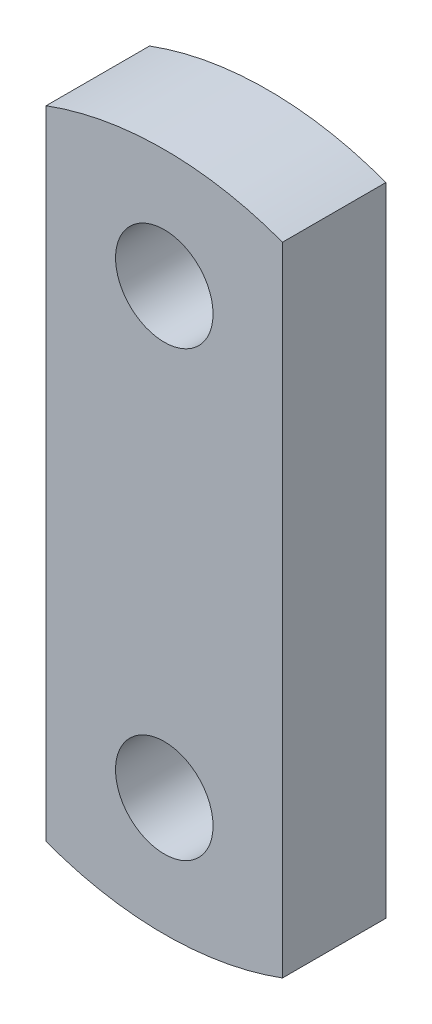
ISO-10303-21;
HEADER;
FILE_DESCRIPTION(('STEP AP214'),'2;1');
FILE_NAME('part.step','',(''),(''),'','','');
FILE_SCHEMA(('AUTOMOTIVE_DESIGN { 1 0 10303 214 1 1 1 1 }'));
ENDSEC;
DATA;
#1=APPLICATION_CONTEXT('core data for automotive mechanical design processes');
#2=APPLICATION_PROTOCOL_DEFINITION('international standard','automotive_design',2000,#1);
#3=PRODUCT_CONTEXT('',#1,'mechanical');
#4=PRODUCT('Part','Part','',(#3));
#5=PRODUCT_RELATED_PRODUCT_CATEGORY('part','',(#4));
#6=PRODUCT_DEFINITION_FORMATION('','',#4);
#7=PRODUCT_DEFINITION_CONTEXT('part definition',#1,'design');
#8=PRODUCT_DEFINITION('design','',#6,#7);
#9=PRODUCT_DEFINITION_SHAPE('','',#8);
#10=(LENGTH_UNIT() NAMED_UNIT(*) SI_UNIT(.MILLI.,.METRE.));
#11=(NAMED_UNIT(*) PLANE_ANGLE_UNIT() SI_UNIT($,.RADIAN.));
#12=(NAMED_UNIT(*) SI_UNIT($,.STERADIAN.) SOLID_ANGLE_UNIT());
#13=UNCERTAINTY_MEASURE_WITH_UNIT(LENGTH_MEASURE(1.E-05),#10,'distance_accuracy_value','');
#14=(GEOMETRIC_REPRESENTATION_CONTEXT(3) GLOBAL_UNCERTAINTY_ASSIGNED_CONTEXT((#13)) GLOBAL_UNIT_ASSIGNED_CONTEXT((#10,
#11,#12)) REPRESENTATION_CONTEXT('',''));
#15=CARTESIAN_POINT('',(0.,0.,0.));
#16=DIRECTION('',(0.,0.,1.));
#17=DIRECTION('',(1.,0.,0.));
#18=AXIS2_PLACEMENT_3D('',#15,#16,#17);
#19=CARTESIAN_POINT('',(-97.3725886780938,23.6588586332778,35.));
#20=DIRECTION('',(0.,0.,1.));
#21=DIRECTION('',(1.,0.,0.));
#22=AXIS2_PLACEMENT_3D('',#19,#20,#21);
#23=PLANE('',#22);
#24=CARTESIAN_POINT('',(-97.3725886780938,98.6588586332778,35.));
#25=DIRECTION('',(0.,0.,1.));
#26=DIRECTION('',(1.,0.,0.));
#27=AXIS2_PLACEMENT_3D('',#24,#25,#26);
#28=CIRCLE('',#27,16.5);
#29=CARTESIAN_POINT('',(-80.8725886780938,98.6588586332778,35.));
#30=VERTEX_POINT('',#29);
#31=EDGE_CURVE('E103',#30,#30,#28,.T.);
#32=ORIENTED_EDGE('',*,*,#31,.F.);
#33=EDGE_LOOP('',(#32));
#34=FACE_BOUND('',#33,.T.);
#35=CARTESIAN_POINT('',(-97.3725886780938,23.6588586332778,35.));
#36=DIRECTION('',(0.,0.,1.));
#37=DIRECTION('',(1.,0.,0.));
#38=AXIS2_PLACEMENT_3D('',#35,#36,#37);
#39=CIRCLE('',#38,115.);
#40=CARTESIAN_POINT('',(-137.372588678094,-84.1604346309613,35.));
#41=VERTEX_POINT('',#40);
#42=CARTESIAN_POINT('',(-57.3725886780938,-84.1604346309613,35.));
#43=VERTEX_POINT('',#42);
#44=EDGE_CURVE('E88',#41,#43,#39,.T.);
#45=ORIENTED_EDGE('',*,*,#44,.T.);
#46=DIRECTION('',(0.,1.,0.));
#47=VECTOR('',#46,1.);
#48=CARTESIAN_POINT('',(-57.3725886780938,131.478151897517,35.));
#49=LINE('',#48,#47);
#50=CARTESIAN_POINT('',(-57.3725886780938,131.478151897517,35.));
#51=VERTEX_POINT('',#50);
#52=EDGE_CURVE('E83',#43,#51,#49,.T.);
#53=ORIENTED_EDGE('',*,*,#52,.T.);
#54=CARTESIAN_POINT('',(-97.3725886780938,23.6588586332778,35.));
#55=DIRECTION('',(0.,0.,1.));
#56=DIRECTION('',(1.,0.,0.));
#57=AXIS2_PLACEMENT_3D('',#54,#55,#56);
#58=CIRCLE('',#57,115.);
#59=CARTESIAN_POINT('',(-137.372588678094,131.478151897517,35.));
#60=VERTEX_POINT('',#59);
#61=EDGE_CURVE('E86',#51,#60,#58,.T.);
#62=ORIENTED_EDGE('',*,*,#61,.T.);
#63=DIRECTION('',(0.,-1.,0.));
#64=VECTOR('',#63,1.);
#65=CARTESIAN_POINT('',(-137.372588678094,131.478151897517,35.));
#66=LINE('',#65,#64);
#67=EDGE_CURVE('E53',#60,#41,#66,.T.);
#68=ORIENTED_EDGE('',*,*,#67,.T.);
#69=EDGE_LOOP('',(#45,#53,#62,#68));
#70=FACE_BOUND('',#69,.T.);
#71=CARTESIAN_POINT('',(-97.3725886780938,-51.3411413667222,35.));
#72=DIRECTION('',(0.,0.,1.));
#73=DIRECTION('',(1.,0.,0.));
#74=AXIS2_PLACEMENT_3D('',#71,#72,#73);
#75=CIRCLE('',#74,16.5);
#76=CARTESIAN_POINT('',(-80.8725886780938,-51.3411413667222,35.));
#77=VERTEX_POINT('',#76);
#78=EDGE_CURVE('E118',#77,#77,#75,.T.);
#79=ORIENTED_EDGE('',*,*,#78,.F.);
#80=EDGE_LOOP('',(#79));
#81=FACE_BOUND('',#80,.T.);
#82=ADVANCED_FACE('F36',(#34,#70,#81),#23,.T.);
#83=CARTESIAN_POINT('',(-97.3725886780938,23.6588586332778,0.));
#84=DIRECTION('',(0.,0.,1.));
#85=DIRECTION('',(1.,0.,0.));
#86=AXIS2_PLACEMENT_3D('',#83,#84,#85);
#87=PLANE('',#86);
#88=CARTESIAN_POINT('',(-97.3725886780938,23.6588586332778,0.));
#89=DIRECTION('',(0.,0.,1.));
#90=DIRECTION('',(1.,0.,0.));
#91=AXIS2_PLACEMENT_3D('',#88,#89,#90);
#92=CIRCLE('',#91,115.);
#93=CARTESIAN_POINT('',(-137.372588678094,-84.1604346309613,0.));
#94=VERTEX_POINT('',#93);
#95=CARTESIAN_POINT('',(-57.3725886780938,-84.1604346309613,0.));
#96=VERTEX_POINT('',#95);
#97=EDGE_CURVE('E100',#94,#96,#92,.T.);
#98=ORIENTED_EDGE('',*,*,#97,.F.);
#99=DIRECTION('',(0.,-1.,0.));
#100=VECTOR('',#99,1.);
#101=CARTESIAN_POINT('',(-137.372588678094,131.478151897517,0.));
#102=LINE('',#101,#100);
#103=CARTESIAN_POINT('',(-137.372588678094,131.478151897517,0.));
#104=VERTEX_POINT('',#103);
#105=EDGE_CURVE('E76',#104,#94,#102,.T.);
#106=ORIENTED_EDGE('',*,*,#105,.F.);
#107=CARTESIAN_POINT('',(-97.3725886780938,23.6588586332778,0.));
#108=DIRECTION('',(0.,0.,1.));
#109=DIRECTION('',(1.,0.,0.));
#110=AXIS2_PLACEMENT_3D('',#107,#108,#109);
#111=CIRCLE('',#110,115.);
#112=CARTESIAN_POINT('',(-57.3725886780938,131.478151897517,0.));
#113=VERTEX_POINT('',#112);
#114=EDGE_CURVE('E70',#113,#104,#111,.T.);
#115=ORIENTED_EDGE('',*,*,#114,.F.);
#116=DIRECTION('',(0.,1.,0.));
#117=VECTOR('',#116,1.);
#118=CARTESIAN_POINT('',(-57.3725886780938,131.478151897517,0.));
#119=LINE('',#118,#117);
#120=EDGE_CURVE('E92',#96,#113,#119,.T.);
#121=ORIENTED_EDGE('',*,*,#120,.F.);
#122=EDGE_LOOP('',(#98,#106,#115,#121));
#123=FACE_BOUND('',#122,.T.);
#124=CARTESIAN_POINT('',(-97.3725886780938,98.6588586332778,0.));
#125=DIRECTION('',(0.,0.,1.));
#126=DIRECTION('',(1.,0.,0.));
#127=AXIS2_PLACEMENT_3D('',#124,#125,#126);
#128=CIRCLE('',#127,16.5);
#129=CARTESIAN_POINT('',(-80.8725886780938,98.6588586332778,0.));
#130=VERTEX_POINT('',#129);
#131=EDGE_CURVE('E115',#130,#130,#128,.T.);
#132=ORIENTED_EDGE('',*,*,#131,.T.);
#133=EDGE_LOOP('',(#132));
#134=FACE_BOUND('',#133,.T.);
#135=CARTESIAN_POINT('',(-97.3725886780938,-51.3411413667222,0.));
#136=DIRECTION('',(0.,0.,1.));
#137=DIRECTION('',(1.,0.,0.));
#138=AXIS2_PLACEMENT_3D('',#135,#136,#137);
#139=CIRCLE('',#138,16.5);
#140=CARTESIAN_POINT('',(-80.8725886780938,-51.3411413667222,0.));
#141=VERTEX_POINT('',#140);
#142=EDGE_CURVE('E121',#141,#141,#139,.T.);
#143=ORIENTED_EDGE('',*,*,#142,.T.);
#144=EDGE_LOOP('',(#143));
#145=FACE_BOUND('',#144,.T.);
#146=ADVANCED_FACE('F111',(#123,#134,#145),#87,.F.);
#147=CARTESIAN_POINT('',(-97.3725886780938,23.6588586332778,35.));
#148=DIRECTION('',(0.,0.,-1.));
#149=DIRECTION('',(-1.,0.,0.));
#150=AXIS2_PLACEMENT_3D('',#147,#148,#149);
#151=CYLINDRICAL_SURFACE('',#150,115.);
#152=ORIENTED_EDGE('',*,*,#97,.T.);
#153=DIRECTION('',(0.,0.,-1.));
#154=VECTOR('',#153,1.);
#155=CARTESIAN_POINT('',(-57.3725886780938,-84.1604346309613,35.));
#156=LINE('',#155,#154);
#157=EDGE_CURVE('E11',#43,#96,#156,.T.);
#158=ORIENTED_EDGE('',*,*,#157,.F.);
#159=ORIENTED_EDGE('',*,*,#44,.F.);
#160=DIRECTION('',(0.,0.,-1.));
#161=VECTOR('',#160,1.);
#162=CARTESIAN_POINT('',(-137.372588678094,-84.1604346309613,35.));
#163=LINE('',#162,#161);
#164=EDGE_CURVE('E96',#41,#94,#163,.T.);
#165=ORIENTED_EDGE('',*,*,#164,.T.);
#166=EDGE_LOOP('',(#152,#158,#159,#165));
#167=FACE_BOUND('',#166,.T.);
#168=ADVANCED_FACE('F38',(#167),#151,.T.);
#169=CARTESIAN_POINT('',(-57.3725886780938,131.478151897517,35.));
#170=DIRECTION('',(-1.,0.,0.));
#171=DIRECTION('',(0.,0.,1.));
#172=AXIS2_PLACEMENT_3D('',#169,#170,#171);
#173=PLANE('',#172);
#174=ORIENTED_EDGE('',*,*,#120,.T.);
#175=DIRECTION('',(0.,0.,-1.));
#176=VECTOR('',#175,1.);
#177=CARTESIAN_POINT('',(-57.3725886780938,131.478151897517,35.));
#178=LINE('',#177,#176);
#179=EDGE_CURVE('E45',#51,#113,#178,.T.);
#180=ORIENTED_EDGE('',*,*,#179,.F.);
#181=ORIENTED_EDGE('',*,*,#52,.F.);
#182=ORIENTED_EDGE('',*,*,#157,.T.);
#183=EDGE_LOOP('',(#174,#180,#181,#182));
#184=FACE_BOUND('',#183,.T.);
#185=ADVANCED_FACE('F91',(#184),#173,.F.);
#186=CARTESIAN_POINT('',(-97.3725886780938,23.6588586332778,35.));
#187=DIRECTION('',(0.,0.,-1.));
#188=DIRECTION('',(-1.,0.,0.));
#189=AXIS2_PLACEMENT_3D('',#186,#187,#188);
#190=CYLINDRICAL_SURFACE('',#189,115.);
#191=ORIENTED_EDGE('',*,*,#114,.T.);
#192=DIRECTION('',(0.,0.,-1.));
#193=VECTOR('',#192,1.);
#194=CARTESIAN_POINT('',(-137.372588678094,131.478151897517,35.));
#195=LINE('',#194,#193);
#196=EDGE_CURVE('E93',#60,#104,#195,.T.);
#197=ORIENTED_EDGE('',*,*,#196,.F.);
#198=ORIENTED_EDGE('',*,*,#61,.F.);
#199=ORIENTED_EDGE('',*,*,#179,.T.);
#200=EDGE_LOOP('',(#191,#197,#198,#199));
#201=FACE_BOUND('',#200,.T.);
#202=ADVANCED_FACE('F94',(#201),#190,.T.);
#203=CARTESIAN_POINT('',(-137.372588678094,131.478151897517,35.));
#204=DIRECTION('',(1.,0.,0.));
#205=DIRECTION('',(0.,0.,-1.));
#206=AXIS2_PLACEMENT_3D('',#203,#204,#205);
#207=PLANE('',#206);
#208=ORIENTED_EDGE('',*,*,#105,.T.);
#209=ORIENTED_EDGE('',*,*,#164,.F.);
#210=ORIENTED_EDGE('',*,*,#67,.F.);
#211=ORIENTED_EDGE('',*,*,#196,.T.);
#212=EDGE_LOOP('',(#208,#209,#210,#211));
#213=FACE_BOUND('',#212,.T.);
#214=ADVANCED_FACE('F108',(#213),#207,.F.);
#215=CARTESIAN_POINT('',(-97.3725886780938,98.6588586332778,35.));
#216=DIRECTION('',(0.,0.,-1.));
#217=DIRECTION('',(-1.,0.,0.));
#218=AXIS2_PLACEMENT_3D('',#215,#216,#217);
#219=CYLINDRICAL_SURFACE('',#218,16.5);
#220=ORIENTED_EDGE('',*,*,#31,.T.);
#221=EDGE_LOOP('',(#220));
#222=FACE_BOUND('',#221,.T.);
#223=ORIENTED_EDGE('',*,*,#131,.F.);
#224=EDGE_LOOP('',(#223));
#225=FACE_BOUND('',#224,.T.);
#226=ADVANCED_FACE('F138',(#222,#225),#219,.F.);
#227=CARTESIAN_POINT('',(-97.3725886780938,-51.3411413667222,35.));
#228=DIRECTION('',(0.,0.,-1.));
#229=DIRECTION('',(-1.,0.,0.));
#230=AXIS2_PLACEMENT_3D('',#227,#228,#229);
#231=CYLINDRICAL_SURFACE('',#230,16.5);
#232=ORIENTED_EDGE('',*,*,#78,.T.);
#233=EDGE_LOOP('',(#232));
#234=FACE_BOUND('',#233,.T.);
#235=ORIENTED_EDGE('',*,*,#142,.F.);
#236=EDGE_LOOP('',(#235));
#237=FACE_BOUND('',#236,.T.);
#238=ADVANCED_FACE('F127',(#234,#237),#231,.F.);
#239=CLOSED_SHELL('',(#82,#146,#168,#185,#202,#214,#226,#238));
#240=MANIFOLD_SOLID_BREP('B2',#239);
#241=ADVANCED_BREP_SHAPE_REPRESENTATION('',(#18,#240),#14);
#242=SHAPE_DEFINITION_REPRESENTATION(#9,#241);
ENDSEC;
END-ISO-10303-21;
